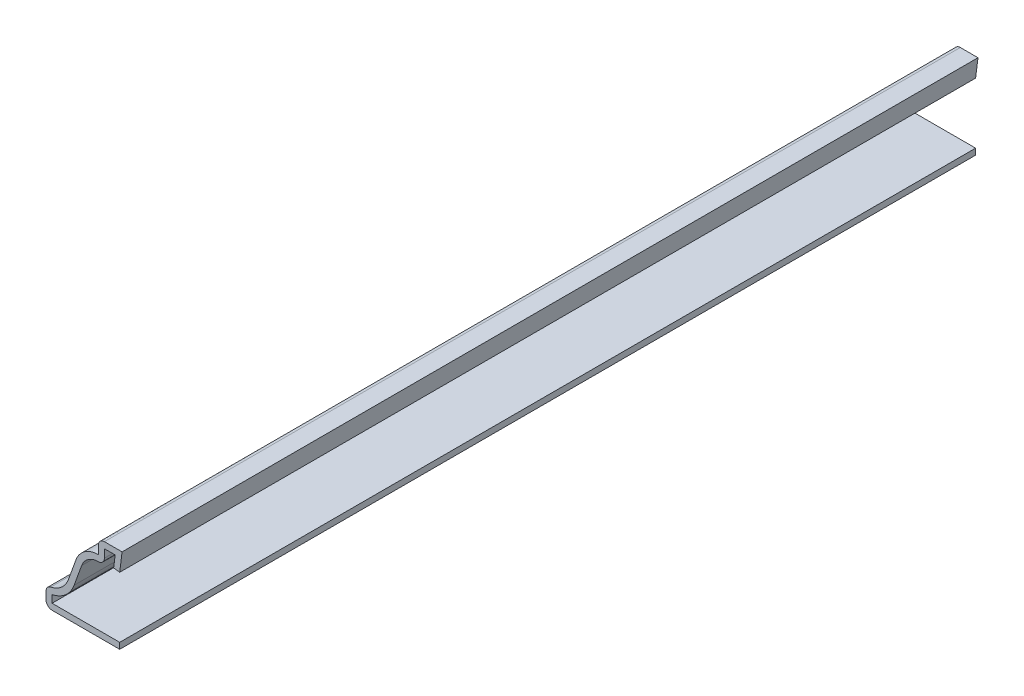
ISO-10303-21;
HEADER;
FILE_DESCRIPTION(('STEP AP214'),'2;1');
FILE_NAME('part.step','',(''),(''),'','','');
FILE_SCHEMA(('AUTOMOTIVE_DESIGN { 1 0 10303 214 1 1 1 1 }'));
ENDSEC;
DATA;
#1=APPLICATION_CONTEXT('core data for automotive mechanical design processes');
#2=APPLICATION_PROTOCOL_DEFINITION('international standard','automotive_design',2000,#1);
#3=PRODUCT_CONTEXT('',#1,'mechanical');
#4=PRODUCT('Part','Part','',(#3));
#5=PRODUCT_RELATED_PRODUCT_CATEGORY('part','',(#4));
#6=PRODUCT_DEFINITION_FORMATION('','',#4);
#7=PRODUCT_DEFINITION_CONTEXT('part definition',#1,'design');
#8=PRODUCT_DEFINITION('design','',#6,#7);
#9=PRODUCT_DEFINITION_SHAPE('','',#8);
#10=(LENGTH_UNIT() NAMED_UNIT(*) SI_UNIT(.MILLI.,.METRE.));
#11=(NAMED_UNIT(*) PLANE_ANGLE_UNIT() SI_UNIT($,.RADIAN.));
#12=(NAMED_UNIT(*) SI_UNIT($,.STERADIAN.) SOLID_ANGLE_UNIT());
#13=UNCERTAINTY_MEASURE_WITH_UNIT(LENGTH_MEASURE(1.E-05),#10,'distance_accuracy_value','');
#14=(GEOMETRIC_REPRESENTATION_CONTEXT(3) GLOBAL_UNCERTAINTY_ASSIGNED_CONTEXT((#13)) GLOBAL_UNIT_ASSIGNED_CONTEXT((#10,
#11,#12)) REPRESENTATION_CONTEXT('',''));
#15=CARTESIAN_POINT('',(0.,0.,0.));
#16=DIRECTION('',(0.,0.,1.));
#17=DIRECTION('',(1.,0.,0.));
#18=AXIS2_PLACEMENT_3D('',#15,#16,#17);
#19=CARTESIAN_POINT('',(-1.00803124951561,14.4145,-142.875));
#20=DIRECTION('',(-0.992156741649221,0.125,0.));
#21=DIRECTION('',(-0.125,-0.992156741649222,0.));
#22=AXIS2_PLACEMENT_3D('',#19,#20,#21);
#23=PLANE('',#22);
#24=DIRECTION('',(-0.125,-0.992156741649222,0.));
#25=VECTOR('',#24,1.);
#26=CARTESIAN_POINT('',(-1.00803124951561,14.4145,0.));
#27=LINE('',#26,#25);
#28=CARTESIAN_POINT('',(-1.15203571373212,13.2715,0.));
#29=VERTEX_POINT('',#28);
#30=CARTESIAN_POINT('',(-1.40490624951561,11.2644023452637,0.));
#31=VERTEX_POINT('',#30);
#32=EDGE_CURVE('E251',#29,#31,#27,.T.);
#33=ORIENTED_EDGE('',*,*,#32,.F.);
#34=DIRECTION('',(0.,0.,1.));
#35=VECTOR('',#34,1.);
#36=CARTESIAN_POINT('',(-1.15203571373212,13.2715,-142.875));
#37=LINE('',#36,#35);
#38=CARTESIAN_POINT('',(-1.15203571373212,13.2715,-142.875));
#39=VERTEX_POINT('',#38);
#40=EDGE_CURVE('E208',#39,#29,#37,.T.);
#41=ORIENTED_EDGE('',*,*,#40,.F.);
#42=DIRECTION('',(-0.125,-0.992156741649222,0.));
#43=VECTOR('',#42,1.);
#44=CARTESIAN_POINT('',(-1.00803124951561,14.4145,-142.875));
#45=LINE('',#44,#43);
#46=CARTESIAN_POINT('',(-1.40490624951561,11.2644023452637,-142.875));
#47=VERTEX_POINT('',#46);
#48=EDGE_CURVE('E189',#39,#47,#45,.T.);
#49=ORIENTED_EDGE('',*,*,#48,.T.);
#50=DIRECTION('',(0.,0.,1.));
#51=VECTOR('',#50,1.);
#52=CARTESIAN_POINT('',(-1.40490624951561,11.2644023452637,-142.875));
#53=LINE('',#52,#51);
#54=EDGE_CURVE('E198',#47,#31,#53,.T.);
#55=ORIENTED_EDGE('',*,*,#54,.T.);
#56=EDGE_LOOP('',(#33,#41,#49,#55));
#57=FACE_BOUND('',#56,.T.);
#58=ADVANCED_FACE('F35',(#57),#23,.T.);
#59=CARTESIAN_POINT('',(-3.96875,13.2715,-142.875));
#60=DIRECTION('',(0.,-1.,0.));
#61=DIRECTION('',(0.,0.,-1.));
#62=AXIS2_PLACEMENT_3D('',#59,#60,#61);
#63=PLANE('',#62);
#64=DIRECTION('',(1.,0.,0.));
#65=VECTOR('',#64,1.);
#66=CARTESIAN_POINT('',(-3.96875,13.2715,0.));
#67=LINE('',#66,#65);
#68=CARTESIAN_POINT('',(-2.95275,13.2715,0.));
#69=VERTEX_POINT('',#68);
#70=EDGE_CURVE('E209',#69,#29,#67,.T.);
#71=ORIENTED_EDGE('',*,*,#70,.F.);
#72=DIRECTION('',(0.,0.,1.));
#73=VECTOR('',#72,1.);
#74=CARTESIAN_POINT('',(-2.95275,13.2715,-142.875));
#75=LINE('',#74,#73);
#76=CARTESIAN_POINT('',(-2.95275,13.2715,-142.875));
#77=VERTEX_POINT('',#76);
#78=EDGE_CURVE('E292',#77,#69,#75,.T.);
#79=ORIENTED_EDGE('',*,*,#78,.F.);
#80=DIRECTION('',(1.,0.,0.));
#81=VECTOR('',#80,1.);
#82=CARTESIAN_POINT('',(-3.96875,13.2715,-142.875));
#83=LINE('',#82,#81);
#84=EDGE_CURVE('E206',#77,#39,#83,.T.);
#85=ORIENTED_EDGE('',*,*,#84,.T.);
#86=ORIENTED_EDGE('',*,*,#40,.T.);
#87=EDGE_LOOP('',(#71,#79,#85,#86));
#88=FACE_BOUND('',#87,.T.);
#89=ADVANCED_FACE('F373',(#88),#63,.T.);
#90=CARTESIAN_POINT('',(-2.95275,11.90625,-142.875));
#91=DIRECTION('',(1.,0.,0.));
#92=DIRECTION('',(0.,0.,-1.));
#93=AXIS2_PLACEMENT_3D('',#90,#91,#92);
#94=PLANE('',#93);
#95=DIRECTION('',(0.,1.,0.));
#96=VECTOR('',#95,1.);
#97=CARTESIAN_POINT('',(-2.95275,11.90625,0.));
#98=LINE('',#97,#96);
#99=CARTESIAN_POINT('',(-2.95275,11.90625,0.));
#100=VERTEX_POINT('',#99);
#101=EDGE_CURVE('E212',#100,#69,#98,.T.);
#102=ORIENTED_EDGE('',*,*,#101,.F.);
#103=DIRECTION('',(0.,0.,1.));
#104=VECTOR('',#103,1.);
#105=CARTESIAN_POINT('',(-2.95275,11.90625,-142.875));
#106=LINE('',#105,#104);
#107=CARTESIAN_POINT('',(-2.95275,11.90625,-142.875));
#108=VERTEX_POINT('',#107);
#109=EDGE_CURVE('E348',#100,#108,#106,.F.);
#110=ORIENTED_EDGE('',*,*,#109,.T.);
#111=DIRECTION('',(0.,1.,0.));
#112=VECTOR('',#111,1.);
#113=CARTESIAN_POINT('',(-2.95275,11.90625,-142.875));
#114=LINE('',#113,#112);
#115=EDGE_CURVE('E248',#108,#77,#114,.T.);
#116=ORIENTED_EDGE('',*,*,#115,.T.);
#117=ORIENTED_EDGE('',*,*,#78,.T.);
#118=EDGE_LOOP('',(#102,#110,#116,#117));
#119=FACE_BOUND('',#118,.T.);
#120=ADVANCED_FACE('F378',(#119),#94,.T.);
#121=CARTESIAN_POINT('',(-3.96875,7.9375,-142.875));
#122=DIRECTION('',(0.,0.,1.));
#123=DIRECTION('',(1.,0.,0.));
#124=AXIS2_PLACEMENT_3D('',#121,#122,#123);
#125=CYLINDRICAL_SURFACE('',#124,2.95275);
#126=CARTESIAN_POINT('',(-3.96875,7.9375,-142.875));
#127=DIRECTION('',(0.,0.,1.));
#128=DIRECTION('',(1.,0.,0.));
#129=AXIS2_PLACEMENT_3D('',#126,#127,#128);
#130=CIRCLE('',#129,2.95275);
#131=CARTESIAN_POINT('',(-6.744587091269,8.94420800395906,-142.875));
#132=VERTEX_POINT('',#131);
#133=CARTESIAN_POINT('',(-3.96875,10.89025,-142.875));
#134=VERTEX_POINT('',#133);
#135=EDGE_CURVE('E245',#132,#134,#130,.F.);
#136=ORIENTED_EDGE('',*,*,#135,.T.);
#137=DIRECTION('',(0.,0.,1.));
#138=VECTOR('',#137,1.);
#139=CARTESIAN_POINT('',(-3.96875,10.89025,-142.875));
#140=LINE('',#139,#138);
#141=CARTESIAN_POINT('',(-3.96875,10.89025,0.));
#142=VERTEX_POINT('',#141);
#143=EDGE_CURVE('E345',#134,#142,#140,.T.);
#144=ORIENTED_EDGE('',*,*,#143,.T.);
#145=CARTESIAN_POINT('',(-3.96875,7.9375,0.));
#146=DIRECTION('',(0.,0.,1.));
#147=DIRECTION('',(1.,0.,0.));
#148=AXIS2_PLACEMENT_3D('',#145,#146,#147);
#149=CIRCLE('',#148,2.95275);
#150=CARTESIAN_POINT('',(-6.744587091269,8.94420800395906,0.));
#151=VERTEX_POINT('',#150);
#152=EDGE_CURVE('E286',#151,#142,#149,.F.);
#153=ORIENTED_EDGE('',*,*,#152,.F.);
#154=DIRECTION('',(0.,0.,1.));
#155=VECTOR('',#154,1.);
#156=CARTESIAN_POINT('',(-6.744587091269,8.94420800395906,-142.875));
#157=LINE('',#156,#155);
#158=EDGE_CURVE('E295',#132,#151,#157,.T.);
#159=ORIENTED_EDGE('',*,*,#158,.F.);
#160=EDGE_LOOP('',(#136,#144,#153,#159));
#161=FACE_BOUND('',#160,.T.);
#162=ADVANCED_FACE('F402',(#161),#125,.F.);
#163=CARTESIAN_POINT('',(-8.01390942656738,5.44425369224116,-142.875));
#164=DIRECTION('',(0.94008537508052,-0.34093912588572,0.));
#165=DIRECTION('',(0.340939125885719,0.94008537508052,0.));
#166=AXIS2_PLACEMENT_3D('',#163,#164,#165);
#167=PLANE('',#166);
#168=DIRECTION('',(0.34093912588572,0.94008537508052,0.));
#169=VECTOR('',#168,1.);
#170=CARTESIAN_POINT('',(-8.01390942656738,5.44425369224116,0.));
#171=LINE('',#170,#169);
#172=CARTESIAN_POINT('',(-8.01390942656738,5.44425369224116,0.));
#173=VERTEX_POINT('',#172);
#174=EDGE_CURVE('E283',#173,#151,#171,.T.);
#175=ORIENTED_EDGE('',*,*,#174,.F.);
#176=DIRECTION('',(0.,0.,1.));
#177=VECTOR('',#176,1.);
#178=CARTESIAN_POINT('',(-8.01390942656738,5.44425369224116,-142.875));
#179=LINE('',#178,#177);
#180=CARTESIAN_POINT('',(-8.01390942656738,5.44425369224116,-142.875));
#181=VERTEX_POINT('',#180);
#182=EDGE_CURVE('E297',#181,#173,#179,.T.);
#183=ORIENTED_EDGE('',*,*,#182,.F.);
#184=DIRECTION('',(0.34093912588572,0.94008537508052,0.));
#185=VECTOR('',#184,1.);
#186=CARTESIAN_POINT('',(-8.01390942656738,5.44425369224116,-142.875));
#187=LINE('',#186,#185);
#188=EDGE_CURVE('E242',#181,#132,#187,.T.);
#189=ORIENTED_EDGE('',*,*,#188,.T.);
#190=ORIENTED_EDGE('',*,*,#158,.T.);
#191=EDGE_LOOP('',(#175,#183,#189,#190));
#192=FACE_BOUND('',#191,.T.);
#193=ADVANCED_FACE('F406',(#192),#167,.T.);
#194=CARTESIAN_POINT('',(-12.7,7.14375,-142.875));
#195=DIRECTION('',(0.,0.,1.));
#196=DIRECTION('',(1.,0.,0.));
#197=AXIS2_PLACEMENT_3D('',#194,#195,#196);
#198=CYLINDRICAL_SURFACE('',#197,4.98475);
#199=CARTESIAN_POINT('',(-12.7,7.14375,0.));
#200=DIRECTION('',(0.,0.,1.));
#201=DIRECTION('',(1.,0.,0.));
#202=AXIS2_PLACEMENT_3D('',#199,#200,#201);
#203=CIRCLE('',#202,4.98475);
#204=CARTESIAN_POINT('',(-11.684,2.26363969771174,0.));
#205=VERTEX_POINT('',#204);
#206=EDGE_CURVE('E280',#205,#173,#203,.T.);
#207=ORIENTED_EDGE('',*,*,#206,.F.);
#208=DIRECTION('',(0.,0.,1.));
#209=VECTOR('',#208,1.);
#210=CARTESIAN_POINT('',(-11.684,2.26363969771174,-142.875));
#211=LINE('',#210,#209);
#212=CARTESIAN_POINT('',(-11.684,2.26363969771174,-142.875));
#213=VERTEX_POINT('',#212);
#214=EDGE_CURVE('E299',#213,#205,#211,.T.);
#215=ORIENTED_EDGE('',*,*,#214,.F.);
#216=CARTESIAN_POINT('',(-12.7,7.14375,-142.875));
#217=DIRECTION('',(0.,0.,1.));
#218=DIRECTION('',(1.,0.,0.));
#219=AXIS2_PLACEMENT_3D('',#216,#217,#218);
#220=CIRCLE('',#219,4.98475);
#221=EDGE_CURVE('E239',#213,#181,#220,.T.);
#222=ORIENTED_EDGE('',*,*,#221,.T.);
#223=ORIENTED_EDGE('',*,*,#182,.T.);
#224=EDGE_LOOP('',(#207,#215,#222,#223));
#225=FACE_BOUND('',#224,.T.);
#226=ADVANCED_FACE('F411',(#225),#198,.T.);
#227=CARTESIAN_POINT('',(-11.684,0.,-142.875));
#228=DIRECTION('',(1.,0.,0.));
#229=DIRECTION('',(0.,0.,-1.));
#230=AXIS2_PLACEMENT_3D('',#227,#228,#229);
#231=PLANE('',#230);
#232=DIRECTION('',(0.,1.,0.));
#233=VECTOR('',#232,1.);
#234=CARTESIAN_POINT('',(-11.684,0.,0.));
#235=LINE('',#234,#233);
#236=CARTESIAN_POINT('',(-11.684,1.016,0.));
#237=VERTEX_POINT('',#236);
#238=EDGE_CURVE('E277',#237,#205,#235,.T.);
#239=ORIENTED_EDGE('',*,*,#238,.F.);
#240=DIRECTION('',(0.,0.,1.));
#241=VECTOR('',#240,1.);
#242=CARTESIAN_POINT('',(-11.684,1.016,-142.875));
#243=LINE('',#242,#241);
#244=CARTESIAN_POINT('',(-11.684,1.016,-142.875));
#245=VERTEX_POINT('',#244);
#246=EDGE_CURVE('E301',#245,#237,#243,.T.);
#247=ORIENTED_EDGE('',*,*,#246,.F.);
#248=DIRECTION('',(0.,1.,0.));
#249=VECTOR('',#248,1.);
#250=CARTESIAN_POINT('',(-11.684,0.,-142.875));
#251=LINE('',#250,#249);
#252=EDGE_CURVE('E236',#245,#213,#251,.T.);
#253=ORIENTED_EDGE('',*,*,#252,.T.);
#254=ORIENTED_EDGE('',*,*,#214,.T.);
#255=EDGE_LOOP('',(#239,#247,#253,#254));
#256=FACE_BOUND('',#255,.T.);
#257=ADVANCED_FACE('F414',(#256),#231,.T.);
#258=CARTESIAN_POINT('',(-0.396875,1.016,-142.875));
#259=DIRECTION('',(0.,1.,0.));
#260=DIRECTION('',(-1.,0.,0.));
#261=AXIS2_PLACEMENT_3D('',#258,#259,#260);
#262=PLANE('',#261);
#263=DIRECTION('',(-1.,0.,0.));
#264=VECTOR('',#263,1.);
#265=CARTESIAN_POINT('',(-0.396875,1.016,0.));
#266=LINE('',#265,#264);
#267=CARTESIAN_POINT('',(-0.396875,1.016,0.));
#268=VERTEX_POINT('',#267);
#269=EDGE_CURVE('E274',#268,#237,#266,.T.);
#270=ORIENTED_EDGE('',*,*,#269,.F.);
#271=DIRECTION('',(0.,0.,1.));
#272=VECTOR('',#271,1.);
#273=CARTESIAN_POINT('',(-0.396875,1.016,-142.875));
#274=LINE('',#273,#272);
#275=CARTESIAN_POINT('',(-0.396875,1.016,-142.875));
#276=VERTEX_POINT('',#275);
#277=EDGE_CURVE('E303',#276,#268,#274,.T.);
#278=ORIENTED_EDGE('',*,*,#277,.F.);
#279=DIRECTION('',(-1.,0.,0.));
#280=VECTOR('',#279,1.);
#281=CARTESIAN_POINT('',(-0.396875,1.016,-142.875));
#282=LINE('',#281,#280);
#283=EDGE_CURVE('E233',#276,#245,#282,.T.);
#284=ORIENTED_EDGE('',*,*,#283,.T.);
#285=ORIENTED_EDGE('',*,*,#246,.T.);
#286=EDGE_LOOP('',(#270,#278,#284,#285));
#287=FACE_BOUND('',#286,.T.);
#288=ADVANCED_FACE('F418',(#287),#262,.T.);
#289=CARTESIAN_POINT('',(-0.396875,1.016,-142.875));
#290=DIRECTION('',(-1.,0.,0.));
#291=DIRECTION('',(0.,0.,1.));
#292=AXIS2_PLACEMENT_3D('',#289,#290,#291);
#293=PLANE('',#292);
#294=DIRECTION('',(0.,-1.,0.));
#295=VECTOR('',#294,1.);
#296=CARTESIAN_POINT('',(-0.396875,1.016,0.));
#297=LINE('',#296,#295);
#298=CARTESIAN_POINT('',(-0.396875,0.,0.));
#299=VERTEX_POINT('',#298);
#300=EDGE_CURVE('E272',#268,#299,#297,.T.);
#301=ORIENTED_EDGE('',*,*,#300,.T.);
#302=DIRECTION('',(0.,0.,1.));
#303=VECTOR('',#302,1.);
#304=CARTESIAN_POINT('',(-0.396875,0.,-142.875));
#305=LINE('',#304,#303);
#306=CARTESIAN_POINT('',(-0.396875,0.,-142.875));
#307=VERTEX_POINT('',#306);
#308=EDGE_CURVE('E305',#307,#299,#305,.T.);
#309=ORIENTED_EDGE('',*,*,#308,.F.);
#310=DIRECTION('',(0.,-1.,0.));
#311=VECTOR('',#310,1.);
#312=CARTESIAN_POINT('',(-0.396875,1.016,-142.875));
#313=LINE('',#312,#311);
#314=EDGE_CURVE('E231',#276,#307,#313,.T.);
#315=ORIENTED_EDGE('',*,*,#314,.F.);
#316=ORIENTED_EDGE('',*,*,#277,.T.);
#317=EDGE_LOOP('',(#301,#309,#315,#316));
#318=FACE_BOUND('',#317,.T.);
#319=ADVANCED_FACE('F423',(#318),#293,.F.);
#320=CARTESIAN_POINT('',(-0.396875,0.,-142.875));
#321=DIRECTION('',(0.,1.,0.));
#322=DIRECTION('',(-1.,0.,0.));
#323=AXIS2_PLACEMENT_3D('',#320,#321,#322);
#324=PLANE('',#323);
#325=DIRECTION('',(-1.,0.,0.));
#326=VECTOR('',#325,1.);
#327=CARTESIAN_POINT('',(-0.396875,0.,0.));
#328=LINE('',#327,#326);
#329=CARTESIAN_POINT('',(-11.684,0.,0.));
#330=VERTEX_POINT('',#329);
#331=EDGE_CURVE('E269',#299,#330,#328,.T.);
#332=ORIENTED_EDGE('',*,*,#331,.T.);
#333=DIRECTION('',(0.,0.,1.));
#334=VECTOR('',#333,1.);
#335=CARTESIAN_POINT('',(-11.684,0.,-142.875));
#336=LINE('',#335,#334);
#337=CARTESIAN_POINT('',(-11.684,0.,-142.875));
#338=VERTEX_POINT('',#337);
#339=EDGE_CURVE('E333',#330,#338,#336,.F.);
#340=ORIENTED_EDGE('',*,*,#339,.T.);
#341=DIRECTION('',(-1.,0.,0.));
#342=VECTOR('',#341,1.);
#343=CARTESIAN_POINT('',(-0.396875,0.,-142.875));
#344=LINE('',#343,#342);
#345=EDGE_CURVE('E229',#307,#338,#344,.T.);
#346=ORIENTED_EDGE('',*,*,#345,.F.);
#347=ORIENTED_EDGE('',*,*,#308,.T.);
#348=EDGE_LOOP('',(#332,#340,#346,#347));
#349=FACE_BOUND('',#348,.T.);
#350=ADVANCED_FACE('F464',(#349),#324,.F.);
#351=CARTESIAN_POINT('',(-12.7,0.,-142.875));
#352=DIRECTION('',(1.,0.,0.));
#353=DIRECTION('',(0.,0.,-1.));
#354=AXIS2_PLACEMENT_3D('',#351,#352,#353);
#355=PLANE('',#354);
#356=DIRECTION('',(0.,1.,0.));
#357=VECTOR('',#356,1.);
#358=CARTESIAN_POINT('',(-12.7,0.,-142.875));
#359=LINE('',#358,#357);
#360=CARTESIAN_POINT('',(-12.7,1.016,-142.875));
#361=VERTEX_POINT('',#360);
#362=CARTESIAN_POINT('',(-12.7,2.26363969771174,-142.875));
#363=VERTEX_POINT('',#362);
#364=EDGE_CURVE('E226',#361,#363,#359,.T.);
#365=ORIENTED_EDGE('',*,*,#364,.F.);
#366=DIRECTION('',(0.,0.,1.));
#367=VECTOR('',#366,1.);
#368=CARTESIAN_POINT('',(-12.7,1.016,-142.875));
#369=LINE('',#368,#367);
#370=CARTESIAN_POINT('',(-12.7,1.016,0.));
#371=VERTEX_POINT('',#370);
#372=EDGE_CURVE('E322',#361,#371,#369,.T.);
#373=ORIENTED_EDGE('',*,*,#372,.T.);
#374=DIRECTION('',(0.,1.,0.));
#375=VECTOR('',#374,1.);
#376=CARTESIAN_POINT('',(-12.7,0.,0.));
#377=LINE('',#376,#375);
#378=CARTESIAN_POINT('',(-12.7,2.26363969771174,0.));
#379=VERTEX_POINT('',#378);
#380=EDGE_CURVE('E266',#371,#379,#377,.T.);
#381=ORIENTED_EDGE('',*,*,#380,.T.);
#382=DIRECTION('',(0.,0.,1.));
#383=VECTOR('',#382,1.);
#384=CARTESIAN_POINT('',(-12.7,2.26363969771174,-142.875));
#385=LINE('',#384,#383);
#386=EDGE_CURVE('E291',#379,#363,#385,.F.);
#387=ORIENTED_EDGE('',*,*,#386,.T.);
#388=EDGE_LOOP('',(#365,#373,#381,#387));
#389=FACE_BOUND('',#388,.T.);
#390=ADVANCED_FACE('F431',(#389),#355,.F.);
#391=CARTESIAN_POINT('',(-12.7,7.14375,-142.875));
#392=DIRECTION('',(0.,0.,1.));
#393=DIRECTION('',(1.,0.,0.));
#394=AXIS2_PLACEMENT_3D('',#391,#392,#393);
#395=CYLINDRICAL_SURFACE('',#394,3.96875);
#396=CARTESIAN_POINT('',(-12.7,7.14375,-142.875));
#397=DIRECTION('',(0.,0.,1.));
#398=DIRECTION('',(1.,0.,0.));
#399=AXIS2_PLACEMENT_3D('',#396,#397,#398);
#400=CIRCLE('',#399,3.96875);
#401=CARTESIAN_POINT('',(-11.8910828025478,3.25831186123546,-142.875));
#402=VERTEX_POINT('',#401);
#403=CARTESIAN_POINT('',(-8.96903616764919,5.79064784414105,-142.875));
#404=VERTEX_POINT('',#403);
#405=EDGE_CURVE('E224',#402,#404,#400,.T.);
#406=ORIENTED_EDGE('',*,*,#405,.F.);
#407=DIRECTION('',(0.,0.,1.));
#408=VECTOR('',#407,1.);
#409=CARTESIAN_POINT('',(-11.8910828025478,3.25831186123546,-142.875));
#410=LINE('',#409,#408);
#411=CARTESIAN_POINT('',(-11.8910828025478,3.25831186123546,0.));
#412=VERTEX_POINT('',#411);
#413=EDGE_CURVE('E342',#402,#412,#410,.T.);
#414=ORIENTED_EDGE('',*,*,#413,.T.);
#415=CARTESIAN_POINT('',(-12.7,7.14375,0.));
#416=DIRECTION('',(0.,0.,1.));
#417=DIRECTION('',(1.,0.,0.));
#418=AXIS2_PLACEMENT_3D('',#415,#416,#417);
#419=CIRCLE('',#418,3.96875);
#420=CARTESIAN_POINT('',(-8.96903616764919,5.79064784414105,0.));
#421=VERTEX_POINT('',#420);
#422=EDGE_CURVE('E264',#412,#421,#419,.T.);
#423=ORIENTED_EDGE('',*,*,#422,.T.);
#424=DIRECTION('',(0.,0.,1.));
#425=VECTOR('',#424,1.);
#426=CARTESIAN_POINT('',(-8.96903616764919,5.79064784414105,-142.875));
#427=LINE('',#426,#425);
#428=EDGE_CURVE('E308',#404,#421,#427,.T.);
#429=ORIENTED_EDGE('',*,*,#428,.F.);
#430=EDGE_LOOP('',(#406,#414,#423,#429));
#431=FACE_BOUND('',#430,.T.);
#432=ADVANCED_FACE('F440',(#431),#395,.F.);
#433=CARTESIAN_POINT('',(-8.96903616764919,5.79064784414105,-142.875));
#434=DIRECTION('',(0.94008537508052,-0.34093912588572,0.));
#435=DIRECTION('',(0.340939125885719,0.94008537508052,0.));
#436=AXIS2_PLACEMENT_3D('',#433,#434,#435);
#437=PLANE('',#436);
#438=DIRECTION('',(0.34093912588572,0.94008537508052,0.));
#439=VECTOR('',#438,1.);
#440=CARTESIAN_POINT('',(-8.96903616764919,5.79064784414105,0.));
#441=LINE('',#440,#439);
#442=CARTESIAN_POINT('',(-7.69971383235081,9.29060215585895,0.));
#443=VERTEX_POINT('',#442);
#444=EDGE_CURVE('E262',#421,#443,#441,.T.);
#445=ORIENTED_EDGE('',*,*,#444,.T.);
#446=DIRECTION('',(0.,0.,1.));
#447=VECTOR('',#446,1.);
#448=CARTESIAN_POINT('',(-7.69971383235081,9.29060215585895,-142.875));
#449=LINE('',#448,#447);
#450=CARTESIAN_POINT('',(-7.69971383235081,9.29060215585895,-142.875));
#451=VERTEX_POINT('',#450);
#452=EDGE_CURVE('E311',#451,#443,#449,.T.);
#453=ORIENTED_EDGE('',*,*,#452,.F.);
#454=DIRECTION('',(0.34093912588572,0.94008537508052,0.));
#455=VECTOR('',#454,1.);
#456=CARTESIAN_POINT('',(-8.96903616764919,5.79064784414105,-142.875));
#457=LINE('',#456,#455);
#458=EDGE_CURVE('E222',#404,#451,#457,.T.);
#459=ORIENTED_EDGE('',*,*,#458,.F.);
#460=ORIENTED_EDGE('',*,*,#428,.T.);
#461=EDGE_LOOP('',(#445,#453,#459,#460));
#462=FACE_BOUND('',#461,.T.);
#463=ADVANCED_FACE('F447',(#462),#437,.F.);
#464=CARTESIAN_POINT('',(-3.96875,7.9375,-142.875));
#465=DIRECTION('',(0.,0.,1.));
#466=DIRECTION('',(1.,0.,0.));
#467=AXIS2_PLACEMENT_3D('',#464,#465,#466);
#468=CYLINDRICAL_SURFACE('',#467,3.96875);
#469=CARTESIAN_POINT('',(-3.96875,7.9375,0.));
#470=DIRECTION('',(0.,0.,-1.));
#471=DIRECTION('',(-1.,0.,0.));
#472=AXIS2_PLACEMENT_3D('',#469,#470,#471);
#473=CIRCLE('',#472,3.96875);
#474=CARTESIAN_POINT('',(-3.96875,11.90625,0.));
#475=VERTEX_POINT('',#474);
#476=EDGE_CURVE('E260',#443,#475,#473,.T.);
#477=ORIENTED_EDGE('',*,*,#476,.T.);
#478=DIRECTION('',(0.,0.,1.));
#479=VECTOR('',#478,1.);
#480=CARTESIAN_POINT('',(-3.96875,11.90625,-142.875));
#481=LINE('',#480,#479);
#482=CARTESIAN_POINT('',(-3.96875,11.90625,-142.875));
#483=VERTEX_POINT('',#482);
#484=EDGE_CURVE('E314',#483,#475,#481,.T.);
#485=ORIENTED_EDGE('',*,*,#484,.F.);
#486=CARTESIAN_POINT('',(-3.96875,7.9375,-142.875));
#487=DIRECTION('',(0.,0.,-1.));
#488=DIRECTION('',(-1.,0.,0.));
#489=AXIS2_PLACEMENT_3D('',#486,#487,#488);
#490=CIRCLE('',#489,3.96875);
#491=EDGE_CURVE('E220',#451,#483,#490,.T.);
#492=ORIENTED_EDGE('',*,*,#491,.F.);
#493=ORIENTED_EDGE('',*,*,#452,.T.);
#494=EDGE_LOOP('',(#477,#485,#492,#493));
#495=FACE_BOUND('',#494,.T.);
#496=ADVANCED_FACE('F450',(#495),#468,.T.);
#497=CARTESIAN_POINT('',(-3.96875,11.90625,-142.875));
#498=DIRECTION('',(1.,0.,0.));
#499=DIRECTION('',(0.,0.,-1.));
#500=AXIS2_PLACEMENT_3D('',#497,#498,#499);
#501=PLANE('',#500);
#502=DIRECTION('',(0.,1.,0.));
#503=VECTOR('',#502,1.);
#504=CARTESIAN_POINT('',(-3.96875,11.90625,0.));
#505=LINE('',#504,#503);
#506=CARTESIAN_POINT('',(-3.96875,13.2715,0.));
#507=VERTEX_POINT('',#506);
#508=EDGE_CURVE('E258',#475,#507,#505,.T.);
#509=ORIENTED_EDGE('',*,*,#508,.T.);
#510=DIRECTION('',(0.,0.,1.));
#511=VECTOR('',#510,1.);
#512=CARTESIAN_POINT('',(-3.96875,13.2715,-142.875));
#513=LINE('',#512,#511);
#514=CARTESIAN_POINT('',(-3.96875,13.2715,-142.875));
#515=VERTEX_POINT('',#514);
#516=EDGE_CURVE('E11',#507,#515,#513,.F.);
#517=ORIENTED_EDGE('',*,*,#516,.T.);
#518=DIRECTION('',(0.,1.,0.));
#519=VECTOR('',#518,1.);
#520=CARTESIAN_POINT('',(-3.96875,11.90625,-142.875));
#521=LINE('',#520,#519);
#522=EDGE_CURVE('E218',#483,#515,#521,.T.);
#523=ORIENTED_EDGE('',*,*,#522,.F.);
#524=ORIENTED_EDGE('',*,*,#484,.T.);
#525=EDGE_LOOP('',(#509,#517,#523,#524));
#526=FACE_BOUND('',#525,.T.);
#527=ADVANCED_FACE('F370',(#526),#501,.F.);
#528=CARTESIAN_POINT('',(-3.96875,14.2875,-142.875));
#529=DIRECTION('',(0.,-1.,0.));
#530=DIRECTION('',(0.,0.,-1.));
#531=AXIS2_PLACEMENT_3D('',#528,#529,#530);
#532=PLANE('',#531);
#533=DIRECTION('',(1.,0.,0.));
#534=VECTOR('',#533,1.);
#535=CARTESIAN_POINT('',(-3.96875,14.2875,-142.875));
#536=LINE('',#535,#534);
#537=CARTESIAN_POINT('',(-2.95275,14.2875,-142.875));
#538=VERTEX_POINT('',#537);
#539=CARTESIAN_POINT('',(0.,14.2875,-142.875));
#540=VERTEX_POINT('',#539);
#541=EDGE_CURVE('E216',#538,#540,#536,.T.);
#542=ORIENTED_EDGE('',*,*,#541,.F.);
#543=DIRECTION('',(0.,0.,1.));
#544=VECTOR('',#543,1.);
#545=CARTESIAN_POINT('',(-2.95275,14.2875,-142.875));
#546=LINE('',#545,#544);
#547=CARTESIAN_POINT('',(-2.95275,14.2875,0.));
#548=VERTEX_POINT('',#547);
#549=EDGE_CURVE('E43',#538,#548,#546,.T.);
#550=ORIENTED_EDGE('',*,*,#549,.T.);
#551=DIRECTION('',(1.,0.,0.));
#552=VECTOR('',#551,1.);
#553=CARTESIAN_POINT('',(-3.96875,14.2875,0.));
#554=LINE('',#553,#552);
#555=CARTESIAN_POINT('',(0.,14.2875,0.));
#556=VERTEX_POINT('',#555);
#557=EDGE_CURVE('E256',#548,#556,#554,.T.);
#558=ORIENTED_EDGE('',*,*,#557,.T.);
#559=DIRECTION('',(0.,0.,1.));
#560=VECTOR('',#559,1.);
#561=CARTESIAN_POINT('',(0.,14.2875,-142.875));
#562=LINE('',#561,#560);
#563=EDGE_CURVE('E317',#540,#556,#562,.T.);
#564=ORIENTED_EDGE('',*,*,#563,.F.);
#565=EDGE_LOOP('',(#542,#550,#558,#564));
#566=FACE_BOUND('',#565,.T.);
#567=ADVANCED_FACE('F353',(#566),#532,.F.);
#568=CARTESIAN_POINT('',(0.,14.2875,-142.875));
#569=DIRECTION('',(-0.992156741649221,0.125,0.));
#570=DIRECTION('',(-0.125,-0.992156741649222,0.));
#571=AXIS2_PLACEMENT_3D('',#568,#569,#570);
#572=PLANE('',#571);
#573=DIRECTION('',(-0.125,-0.992156741649221,0.));
#574=VECTOR('',#573,1.);
#575=CARTESIAN_POINT('',(0.,14.2875,0.));
#576=LINE('',#575,#574);
#577=CARTESIAN_POINT('',(-0.396875,11.1374023452637,0.));
#578=VERTEX_POINT('',#577);
#579=EDGE_CURVE('E254',#556,#578,#576,.T.);
#580=ORIENTED_EDGE('',*,*,#579,.T.);
#581=DIRECTION('',(0.,0.,1.));
#582=VECTOR('',#581,1.);
#583=CARTESIAN_POINT('',(-0.396875,11.1374023452637,-142.875));
#584=LINE('',#583,#582);
#585=CARTESIAN_POINT('',(-0.396875,11.1374023452637,-142.875));
#586=VERTEX_POINT('',#585);
#587=EDGE_CURVE('E205',#586,#578,#584,.T.);
#588=ORIENTED_EDGE('',*,*,#587,.F.);
#589=DIRECTION('',(-0.125,-0.992156741649221,0.));
#590=VECTOR('',#589,1.);
#591=CARTESIAN_POINT('',(0.,14.2875,-142.875));
#592=LINE('',#591,#590);
#593=EDGE_CURVE('E192',#540,#586,#592,.T.);
#594=ORIENTED_EDGE('',*,*,#593,.F.);
#595=ORIENTED_EDGE('',*,*,#563,.T.);
#596=EDGE_LOOP('',(#580,#588,#594,#595));
#597=FACE_BOUND('',#596,.T.);
#598=ADVANCED_FACE('F362',(#597),#572,.F.);
#599=CARTESIAN_POINT('',(-0.396875,11.1374023452637,-142.875));
#600=DIRECTION('',(0.125,0.992156741649221,0.));
#601=DIRECTION('',(-0.992156741649221,0.125,0.));
#602=AXIS2_PLACEMENT_3D('',#599,#600,#601);
#603=PLANE('',#602);
#604=DIRECTION('',(-0.992156741649221,0.125,0.));
#605=VECTOR('',#604,1.);
#606=CARTESIAN_POINT('',(-0.396875,11.1374023452637,0.));
#607=LINE('',#606,#605);
#608=EDGE_CURVE('E201',#578,#31,#607,.T.);
#609=ORIENTED_EDGE('',*,*,#608,.T.);
#610=ORIENTED_EDGE('',*,*,#54,.F.);
#611=DIRECTION('',(-0.992156741649221,0.125,0.));
#612=VECTOR('',#611,1.);
#613=CARTESIAN_POINT('',(-0.396875,11.1374023452637,-142.875));
#614=LINE('',#613,#612);
#615=EDGE_CURVE('E183',#586,#47,#614,.T.);
#616=ORIENTED_EDGE('',*,*,#615,.F.);
#617=ORIENTED_EDGE('',*,*,#587,.T.);
#618=EDGE_LOOP('',(#609,#610,#616,#617));
#619=FACE_BOUND('',#618,.T.);
#620=ADVANCED_FACE('F199',(#619),#603,.F.);
#621=CARTESIAN_POINT('',(-3.96875,7.9375,-142.875));
#622=DIRECTION('',(0.,0.,-1.));
#623=DIRECTION('',(-1.,0.,0.));
#624=AXIS2_PLACEMENT_3D('',#621,#622,#623);
#625=PLANE('',#624);
#626=ORIENTED_EDGE('',*,*,#345,.T.);
#627=CARTESIAN_POINT('',(-11.684,1.016,-142.875));
#628=DIRECTION('',(0.,0.,-1.));
#629=DIRECTION('',(-1.,0.,0.));
#630=AXIS2_PLACEMENT_3D('',#627,#628,#629);
#631=CIRCLE('',#630,1.016);
#632=EDGE_CURVE('E340',#338,#361,#631,.T.);
#633=ORIENTED_EDGE('',*,*,#632,.T.);
#634=ORIENTED_EDGE('',*,*,#364,.T.);
#635=CARTESIAN_POINT('',(-11.684,2.26363969771174,-142.875));
#636=DIRECTION('',(0.,0.,-1.));
#637=DIRECTION('',(-1.,0.,0.));
#638=AXIS2_PLACEMENT_3D('',#635,#636,#637);
#639=CIRCLE('',#638,1.016);
#640=EDGE_CURVE('E338',#363,#402,#639,.T.);
#641=ORIENTED_EDGE('',*,*,#640,.T.);
#642=ORIENTED_EDGE('',*,*,#405,.T.);
#643=ORIENTED_EDGE('',*,*,#458,.T.);
#644=ORIENTED_EDGE('',*,*,#491,.T.);
#645=ORIENTED_EDGE('',*,*,#522,.T.);
#646=CARTESIAN_POINT('',(-2.95275,13.2715,-142.875));
#647=DIRECTION('',(0.,0.,-1.));
#648=DIRECTION('',(-1.,0.,0.));
#649=AXIS2_PLACEMENT_3D('',#646,#647,#648);
#650=CIRCLE('',#649,1.016);
#651=EDGE_CURVE('E50',#515,#538,#650,.T.);
#652=ORIENTED_EDGE('',*,*,#651,.T.);
#653=ORIENTED_EDGE('',*,*,#541,.T.);
#654=ORIENTED_EDGE('',*,*,#593,.T.);
#655=ORIENTED_EDGE('',*,*,#615,.T.);
#656=ORIENTED_EDGE('',*,*,#48,.F.);
#657=ORIENTED_EDGE('',*,*,#84,.F.);
#658=ORIENTED_EDGE('',*,*,#115,.F.);
#659=CARTESIAN_POINT('',(-3.96875,11.90625,-142.875));
#660=DIRECTION('',(0.,0.,-1.));
#661=DIRECTION('',(-1.,0.,0.));
#662=AXIS2_PLACEMENT_3D('',#659,#660,#661);
#663=CIRCLE('',#662,1.016);
#664=EDGE_CURVE('E336',#108,#134,#663,.T.);
#665=ORIENTED_EDGE('',*,*,#664,.T.);
#666=ORIENTED_EDGE('',*,*,#135,.F.);
#667=ORIENTED_EDGE('',*,*,#188,.F.);
#668=ORIENTED_EDGE('',*,*,#221,.F.);
#669=ORIENTED_EDGE('',*,*,#252,.F.);
#670=ORIENTED_EDGE('',*,*,#283,.F.);
#671=ORIENTED_EDGE('',*,*,#314,.T.);
#672=EDGE_LOOP('',(#626,#633,#634,#641,#642,#643,#644,#645,#652,#653,#654,#655,#656,#657,#658,
#665,#666,#667,#668,#669,#670,#671));
#673=FACE_BOUND('',#672,.T.);
#674=ADVANCED_FACE('F186',(#673),#625,.T.);
#675=CARTESIAN_POINT('',(-3.96875,7.9375,0.));
#676=DIRECTION('',(0.,0.,-1.));
#677=DIRECTION('',(-1.,0.,0.));
#678=AXIS2_PLACEMENT_3D('',#675,#676,#677);
#679=PLANE('',#678);
#680=ORIENTED_EDGE('',*,*,#380,.F.);
#681=CARTESIAN_POINT('',(-11.684,1.016,0.));
#682=DIRECTION('',(0.,0.,-1.));
#683=DIRECTION('',(-1.,0.,0.));
#684=AXIS2_PLACEMENT_3D('',#681,#682,#683);
#685=CIRCLE('',#684,1.016);
#686=EDGE_CURVE('E331',#371,#330,#685,.F.);
#687=ORIENTED_EDGE('',*,*,#686,.T.);
#688=ORIENTED_EDGE('',*,*,#331,.F.);
#689=ORIENTED_EDGE('',*,*,#300,.F.);
#690=ORIENTED_EDGE('',*,*,#269,.T.);
#691=ORIENTED_EDGE('',*,*,#238,.T.);
#692=ORIENTED_EDGE('',*,*,#206,.T.);
#693=ORIENTED_EDGE('',*,*,#174,.T.);
#694=ORIENTED_EDGE('',*,*,#152,.T.);
#695=CARTESIAN_POINT('',(-3.96875,11.90625,0.));
#696=DIRECTION('',(0.,0.,-1.));
#697=DIRECTION('',(-1.,0.,0.));
#698=AXIS2_PLACEMENT_3D('',#695,#696,#697);
#699=CIRCLE('',#698,1.016);
#700=EDGE_CURVE('E327',#142,#100,#699,.F.);
#701=ORIENTED_EDGE('',*,*,#700,.T.);
#702=ORIENTED_EDGE('',*,*,#101,.T.);
#703=ORIENTED_EDGE('',*,*,#70,.T.);
#704=ORIENTED_EDGE('',*,*,#32,.T.);
#705=ORIENTED_EDGE('',*,*,#608,.F.);
#706=ORIENTED_EDGE('',*,*,#579,.F.);
#707=ORIENTED_EDGE('',*,*,#557,.F.);
#708=CARTESIAN_POINT('',(-2.95275,13.2715,0.));
#709=DIRECTION('',(0.,0.,-1.));
#710=DIRECTION('',(-1.,0.,0.));
#711=AXIS2_PLACEMENT_3D('',#708,#709,#710);
#712=CIRCLE('',#711,1.016);
#713=EDGE_CURVE('E325',#548,#507,#712,.F.);
#714=ORIENTED_EDGE('',*,*,#713,.T.);
#715=ORIENTED_EDGE('',*,*,#508,.F.);
#716=ORIENTED_EDGE('',*,*,#476,.F.);
#717=ORIENTED_EDGE('',*,*,#444,.F.);
#718=ORIENTED_EDGE('',*,*,#422,.F.);
#719=CARTESIAN_POINT('',(-11.684,2.26363969771174,0.));
#720=DIRECTION('',(0.,0.,-1.));
#721=DIRECTION('',(-1.,0.,0.));
#722=AXIS2_PLACEMENT_3D('',#719,#720,#721);
#723=CIRCLE('',#722,1.016);
#724=EDGE_CURVE('E329',#412,#379,#723,.F.);
#725=ORIENTED_EDGE('',*,*,#724,.T.);
#726=EDGE_LOOP('',(#680,#687,#688,#689,#690,#691,#692,#693,#694,#701,#702,#703,#704,#705,#706,
#707,#714,#715,#716,#717,#718,#725));
#727=FACE_BOUND('',#726,.T.);
#728=ADVANCED_FACE('F359',(#727),#679,.F.);
#729=CARTESIAN_POINT('',(-11.684,1.016,-142.875));
#730=DIRECTION('',(0.,0.,1.));
#731=DIRECTION('',(1.,0.,0.));
#732=AXIS2_PLACEMENT_3D('',#729,#730,#731);
#733=CYLINDRICAL_SURFACE('',#732,1.016);
#734=ORIENTED_EDGE('',*,*,#632,.F.);
#735=ORIENTED_EDGE('',*,*,#339,.F.);
#736=ORIENTED_EDGE('',*,*,#686,.F.);
#737=ORIENTED_EDGE('',*,*,#372,.F.);
#738=EDGE_LOOP('',(#734,#735,#736,#737));
#739=FACE_BOUND('',#738,.T.);
#740=ADVANCED_FACE('F382',(#739),#733,.T.);
#741=CARTESIAN_POINT('',(-11.684,2.26363969771174,-142.875));
#742=DIRECTION('',(0.,0.,1.));
#743=DIRECTION('',(1.,0.,0.));
#744=AXIS2_PLACEMENT_3D('',#741,#742,#743);
#745=CYLINDRICAL_SURFACE('',#744,1.016);
#746=ORIENTED_EDGE('',*,*,#640,.F.);
#747=ORIENTED_EDGE('',*,*,#386,.F.);
#748=ORIENTED_EDGE('',*,*,#724,.F.);
#749=ORIENTED_EDGE('',*,*,#413,.F.);
#750=EDGE_LOOP('',(#746,#747,#748,#749));
#751=FACE_BOUND('',#750,.T.);
#752=ADVANCED_FACE('F385',(#751),#745,.T.);
#753=CARTESIAN_POINT('',(-3.96875,11.90625,-142.875));
#754=DIRECTION('',(0.,0.,1.));
#755=DIRECTION('',(1.,0.,0.));
#756=AXIS2_PLACEMENT_3D('',#753,#754,#755);
#757=CYLINDRICAL_SURFACE('',#756,1.016);
#758=ORIENTED_EDGE('',*,*,#664,.F.);
#759=ORIENTED_EDGE('',*,*,#109,.F.);
#760=ORIENTED_EDGE('',*,*,#700,.F.);
#761=ORIENTED_EDGE('',*,*,#143,.F.);
#762=EDGE_LOOP('',(#758,#759,#760,#761));
#763=FACE_BOUND('',#762,.T.);
#764=ADVANCED_FACE('F388',(#763),#757,.T.);
#765=CARTESIAN_POINT('',(-2.95275,13.2715,-142.875));
#766=DIRECTION('',(0.,0.,1.));
#767=DIRECTION('',(1.,0.,0.));
#768=AXIS2_PLACEMENT_3D('',#765,#766,#767);
#769=CYLINDRICAL_SURFACE('',#768,1.016);
#770=ORIENTED_EDGE('',*,*,#651,.F.);
#771=ORIENTED_EDGE('',*,*,#516,.F.);
#772=ORIENTED_EDGE('',*,*,#713,.F.);
#773=ORIENTED_EDGE('',*,*,#549,.F.);
#774=EDGE_LOOP('',(#770,#771,#772,#773));
#775=FACE_BOUND('',#774,.T.);
#776=ADVANCED_FACE('F37',(#775),#769,.T.);
#777=CLOSED_SHELL('',(#58,#89,#120,#162,#193,#226,#257,#288,#319,#350,#390,#432,#463,#496,#527,
#567,#598,#620,#674,#728,#740,#752,#764,#776));
#778=MANIFOLD_SOLID_BREP('B2',#777);
#779=ADVANCED_BREP_SHAPE_REPRESENTATION('',(#18,#778),#14);
#780=SHAPE_DEFINITION_REPRESENTATION(#9,#779);
ENDSEC;
END-ISO-10303-21;
